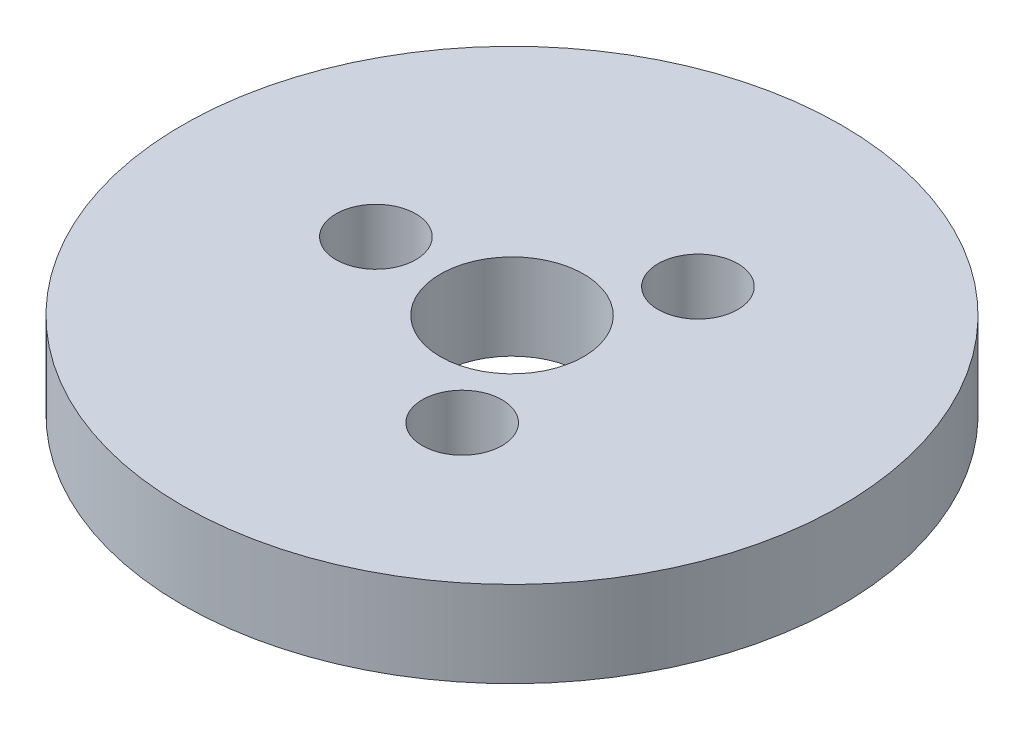
ISO-10303-21;
HEADER;
FILE_DESCRIPTION(('STEP AP214'),'2;1');
FILE_NAME('part.step','',(''),(''),'','','');
FILE_SCHEMA(('AUTOMOTIVE_DESIGN { 1 0 10303 214 1 1 1 1 }'));
ENDSEC;
DATA;
#1=APPLICATION_CONTEXT('core data for automotive mechanical design processes');
#2=APPLICATION_PROTOCOL_DEFINITION('international standard','automotive_design',2000,#1);
#3=PRODUCT_CONTEXT('',#1,'mechanical');
#4=PRODUCT('Part','Part','',(#3));
#5=PRODUCT_RELATED_PRODUCT_CATEGORY('part','',(#4));
#6=PRODUCT_DEFINITION_FORMATION('','',#4);
#7=PRODUCT_DEFINITION_CONTEXT('part definition',#1,'design');
#8=PRODUCT_DEFINITION('design','',#6,#7);
#9=PRODUCT_DEFINITION_SHAPE('','',#8);
#10=(LENGTH_UNIT() NAMED_UNIT(*) SI_UNIT(.MILLI.,.METRE.));
#11=(NAMED_UNIT(*) PLANE_ANGLE_UNIT() SI_UNIT($,.RADIAN.));
#12=(NAMED_UNIT(*) SI_UNIT($,.STERADIAN.) SOLID_ANGLE_UNIT());
#13=UNCERTAINTY_MEASURE_WITH_UNIT(LENGTH_MEASURE(1.E-05),#10,'distance_accuracy_value','');
#14=(GEOMETRIC_REPRESENTATION_CONTEXT(3) GLOBAL_UNCERTAINTY_ASSIGNED_CONTEXT((#13)) GLOBAL_UNIT_ASSIGNED_CONTEXT((#10,
#11,#12)) REPRESENTATION_CONTEXT('',''));
#15=CARTESIAN_POINT('',(0.,0.,0.));
#16=DIRECTION('',(0.,0.,1.));
#17=DIRECTION('',(1.,0.,0.));
#18=AXIS2_PLACEMENT_3D('',#15,#16,#17);
#19=CARTESIAN_POINT('',(0.,15.,0.));
#20=DIRECTION('',(0.,-1.,0.));
#21=DIRECTION('',(0.,0.,-1.));
#22=AXIS2_PLACEMENT_3D('',#19,#20,#21);
#23=CYLINDRICAL_SURFACE('',#22,57.5);
#24=CARTESIAN_POINT('',(0.,15.,0.));
#25=DIRECTION('',(0.,1.,0.));
#26=DIRECTION('',(0.,0.,1.));
#27=AXIS2_PLACEMENT_3D('',#24,#25,#26);
#28=CIRCLE('',#27,57.5);
#29=CARTESIAN_POINT('',(0.,15.,57.5));
#30=VERTEX_POINT('',#29);
#31=EDGE_CURVE('E10',#30,#30,#28,.T.);
#32=ORIENTED_EDGE('',*,*,#31,.F.);
#33=EDGE_LOOP('',(#32));
#34=FACE_BOUND('',#33,.T.);
#35=CARTESIAN_POINT('',(0.,0.,0.));
#36=DIRECTION('',(0.,1.,0.));
#37=DIRECTION('',(0.,0.,1.));
#38=AXIS2_PLACEMENT_3D('',#35,#36,#37);
#39=CIRCLE('',#38,57.5);
#40=CARTESIAN_POINT('',(0.,0.,57.5));
#41=VERTEX_POINT('',#40);
#42=EDGE_CURVE('E37',#41,#41,#39,.T.);
#43=ORIENTED_EDGE('',*,*,#42,.T.);
#44=EDGE_LOOP('',(#43));
#45=FACE_BOUND('',#44,.T.);
#46=ADVANCED_FACE('F40',(#34,#45),#23,.T.);
#47=CARTESIAN_POINT('',(0.,15.,0.));
#48=DIRECTION('',(0.,1.,0.));
#49=DIRECTION('',(0.,0.,1.));
#50=AXIS2_PLACEMENT_3D('',#47,#48,#49);
#51=PLANE('',#50);
#52=CARTESIAN_POINT('',(11.8737836575579,15.,20.5659965729711));
#53=DIRECTION('',(0.,1.,0.));
#54=DIRECTION('',(0.866025403784436,0.,-0.500000000000004));
#55=AXIS2_PLACEMENT_3D('',#52,#53,#54);
#56=CIRCLE('',#55,6.95188164435148);
#57=CARTESIAN_POINT('',(17.894289765669,15.,17.0900557507953));
#58=VERTEX_POINT('',#57);
#59=EDGE_CURVE('E70',#58,#58,#56,.T.);
#60=ORIENTED_EDGE('',*,*,#59,.F.);
#61=EDGE_LOOP('',(#60));
#62=FACE_BOUND('',#61,.T.);
#63=CARTESIAN_POINT('',(11.8737836575576,15.,-20.5659965729713));
#64=DIRECTION('',(0.,1.,0.));
#65=DIRECTION('',(-0.866025403784443,0.,-0.499999999999992));
#66=AXIS2_PLACEMENT_3D('',#63,#64,#65);
#67=CIRCLE('',#66,6.95188164435148);
#68=CARTESIAN_POINT('',(5.85327754944647,15.,-24.0419373951469));
#69=VERTEX_POINT('',#68);
#70=EDGE_CURVE('E61',#69,#69,#67,.T.);
#71=ORIENTED_EDGE('',*,*,#70,.F.);
#72=EDGE_LOOP('',(#71));
#73=FACE_BOUND('',#72,.T.);
#74=CARTESIAN_POINT('',(-23.7475673151156,15.,0.));
#75=DIRECTION('',(0.,1.,0.));
#76=DIRECTION('',(0.,0.,1.));
#77=AXIS2_PLACEMENT_3D('',#74,#75,#76);
#78=CIRCLE('',#77,6.95188164435148);
#79=CARTESIAN_POINT('',(-23.7475673151156,15.,6.95188164435148));
#80=VERTEX_POINT('',#79);
#81=EDGE_CURVE('E54',#80,#80,#78,.T.);
#82=ORIENTED_EDGE('',*,*,#81,.F.);
#83=EDGE_LOOP('',(#82));
#84=FACE_BOUND('',#83,.T.);
#85=CARTESIAN_POINT('',(0.,15.,0.));
#86=DIRECTION('',(0.,1.,0.));
#87=DIRECTION('',(0.,0.,1.));
#88=AXIS2_PLACEMENT_3D('',#85,#86,#87);
#89=CIRCLE('',#88,12.5);
#90=CARTESIAN_POINT('',(0.,15.,12.5));
#91=VERTEX_POINT('',#90);
#92=EDGE_CURVE('E50',#91,#91,#89,.T.);
#93=ORIENTED_EDGE('',*,*,#92,.F.);
#94=EDGE_LOOP('',(#93));
#95=FACE_BOUND('',#94,.T.);
#96=ORIENTED_EDGE('',*,*,#31,.T.);
#97=EDGE_LOOP('',(#96));
#98=FACE_BOUND('',#97,.T.);
#99=ADVANCED_FACE('F85',(#62,#73,#84,#95,#98),#51,.T.);
#100=CARTESIAN_POINT('',(0.,0.,0.));
#101=DIRECTION('',(0.,1.,0.));
#102=DIRECTION('',(0.,0.,1.));
#103=AXIS2_PLACEMENT_3D('',#100,#101,#102);
#104=PLANE('',#103);
#105=CARTESIAN_POINT('',(0.,0.,0.));
#106=DIRECTION('',(0.,1.,0.));
#107=DIRECTION('',(0.,0.,1.));
#108=AXIS2_PLACEMENT_3D('',#105,#106,#107);
#109=CIRCLE('',#108,12.5);
#110=CARTESIAN_POINT('',(0.,0.,12.5));
#111=VERTEX_POINT('',#110);
#112=EDGE_CURVE('E47',#111,#111,#109,.T.);
#113=ORIENTED_EDGE('',*,*,#112,.T.);
#114=EDGE_LOOP('',(#113));
#115=FACE_BOUND('',#114,.T.);
#116=ORIENTED_EDGE('',*,*,#42,.F.);
#117=EDGE_LOOP('',(#116));
#118=FACE_BOUND('',#117,.T.);
#119=ADVANCED_FACE('F84',(#115,#118),#104,.F.);
#120=CARTESIAN_POINT('',(0.,15.,0.));
#121=DIRECTION('',(0.,-1.,0.));
#122=DIRECTION('',(0.,0.,-1.));
#123=AXIS2_PLACEMENT_3D('',#120,#121,#122);
#124=CYLINDRICAL_SURFACE('',#123,12.5);
#125=ORIENTED_EDGE('',*,*,#92,.T.);
#126=EDGE_LOOP('',(#125));
#127=FACE_BOUND('',#126,.T.);
#128=ORIENTED_EDGE('',*,*,#112,.F.);
#129=EDGE_LOOP('',(#128));
#130=FACE_BOUND('',#129,.T.);
#131=ADVANCED_FACE('F91',(#127,#130),#124,.F.);
#132=CARTESIAN_POINT('',(-23.7475673151156,4.11348866548061,0.));
#133=DIRECTION('',(0.,1.,0.));
#134=DIRECTION('',(0.,0.,1.));
#135=AXIS2_PLACEMENT_3D('',#132,#133,#134);
#136=CYLINDRICAL_SURFACE('',#135,6.95188164435148);
#137=CARTESIAN_POINT('',(-23.7475673151156,4.11348866548061,0.));
#138=DIRECTION('',(0.,1.,0.));
#139=DIRECTION('',(0.,0.,1.));
#140=AXIS2_PLACEMENT_3D('',#137,#138,#139);
#141=CIRCLE('',#140,6.95188164435148);
#142=CARTESIAN_POINT('',(-23.7475673151156,4.11348866548061,6.95188164435148));
#143=VERTEX_POINT('',#142);
#144=EDGE_CURVE('E55',#143,#143,#141,.T.);
#145=ORIENTED_EDGE('',*,*,#144,.F.);
#146=EDGE_LOOP('',(#145));
#147=FACE_BOUND('',#146,.T.);
#148=ORIENTED_EDGE('',*,*,#81,.T.);
#149=EDGE_LOOP('',(#148));
#150=FACE_BOUND('',#149,.T.);
#151=ADVANCED_FACE('F96',(#147,#150),#136,.F.);
#152=CARTESIAN_POINT('',(-23.7475673151156,4.11348866548061,0.));
#153=DIRECTION('',(0.,1.,0.));
#154=DIRECTION('',(0.,0.,1.));
#155=AXIS2_PLACEMENT_3D('',#152,#153,#154);
#156=PLANE('',#155);
#157=ORIENTED_EDGE('',*,*,#144,.T.);
#158=EDGE_LOOP('',(#157));
#159=FACE_BOUND('',#158,.T.);
#160=ADVANCED_FACE('F127',(#159),#156,.T.);
#161=CARTESIAN_POINT('',(11.8737836575576,4.11348866548061,-20.5659965729713));
#162=DIRECTION('',(0.,1.,0.));
#163=DIRECTION('',(0.,0.,1.));
#164=AXIS2_PLACEMENT_3D('',#161,#162,#163);
#165=CYLINDRICAL_SURFACE('',#164,6.95188164435148);
#166=CARTESIAN_POINT('',(11.8737836575576,4.11348866548061,-20.5659965729713));
#167=DIRECTION('',(0.,1.,0.));
#168=DIRECTION('',(-0.866025403784443,0.,-0.499999999999992));
#169=AXIS2_PLACEMENT_3D('',#166,#167,#168);
#170=CIRCLE('',#169,6.95188164435148);
#171=CARTESIAN_POINT('',(5.85327754944647,4.11348866548061,-24.0419373951469));
#172=VERTEX_POINT('',#171);
#173=EDGE_CURVE('E63',#172,#172,#170,.T.);
#174=ORIENTED_EDGE('',*,*,#173,.F.);
#175=EDGE_LOOP('',(#174));
#176=FACE_BOUND('',#175,.T.);
#177=ORIENTED_EDGE('',*,*,#70,.T.);
#178=EDGE_LOOP('',(#177));
#179=FACE_BOUND('',#178,.T.);
#180=ADVANCED_FACE('F133',(#176,#179),#165,.F.);
#181=CARTESIAN_POINT('',(11.8737836575576,4.11348866548061,-20.5659965729713));
#182=DIRECTION('',(0.,1.,0.));
#183=DIRECTION('',(-0.866025403784443,0.,-0.499999999999992));
#184=AXIS2_PLACEMENT_3D('',#181,#182,#183);
#185=PLANE('',#184);
#186=ORIENTED_EDGE('',*,*,#173,.T.);
#187=EDGE_LOOP('',(#186));
#188=FACE_BOUND('',#187,.T.);
#189=ADVANCED_FACE('F77',(#188),#185,.T.);
#190=CARTESIAN_POINT('',(11.8737836575579,4.11348866548061,20.5659965729711));
#191=DIRECTION('',(0.,1.,0.));
#192=DIRECTION('',(0.,0.,1.));
#193=AXIS2_PLACEMENT_3D('',#190,#191,#192);
#194=CYLINDRICAL_SURFACE('',#193,6.95188164435148);
#195=CARTESIAN_POINT('',(11.8737836575579,4.11348866548061,20.5659965729711));
#196=DIRECTION('',(0.,1.,0.));
#197=DIRECTION('',(0.866025403784436,0.,-0.500000000000004));
#198=AXIS2_PLACEMENT_3D('',#195,#196,#197);
#199=CIRCLE('',#198,6.95188164435148);
#200=CARTESIAN_POINT('',(17.894289765669,4.11348866548061,17.0900557507953));
#201=VERTEX_POINT('',#200);
#202=EDGE_CURVE('E59',#201,#201,#199,.T.);
#203=ORIENTED_EDGE('',*,*,#202,.F.);
#204=EDGE_LOOP('',(#203));
#205=FACE_BOUND('',#204,.T.);
#206=ORIENTED_EDGE('',*,*,#59,.T.);
#207=EDGE_LOOP('',(#206));
#208=FACE_BOUND('',#207,.T.);
#209=ADVANCED_FACE('F73',(#205,#208),#194,.F.);
#210=CARTESIAN_POINT('',(11.8737836575579,4.11348866548061,20.5659965729711));
#211=DIRECTION('',(0.,1.,0.));
#212=DIRECTION('',(0.866025403784436,0.,-0.500000000000004));
#213=AXIS2_PLACEMENT_3D('',#210,#211,#212);
#214=PLANE('',#213);
#215=ORIENTED_EDGE('',*,*,#202,.T.);
#216=EDGE_LOOP('',(#215));
#217=FACE_BOUND('',#216,.T.);
#218=ADVANCED_FACE('F71',(#217),#214,.T.);
#219=CLOSED_SHELL('',(#46,#99,#119,#131,#151,#160,#180,#189,#209,#218));
#220=MANIFOLD_SOLID_BREP('B2',#219);
#221=ADVANCED_BREP_SHAPE_REPRESENTATION('',(#18,#220),#14);
#222=SHAPE_DEFINITION_REPRESENTATION(#9,#221);
ENDSEC;
END-ISO-10303-21;
